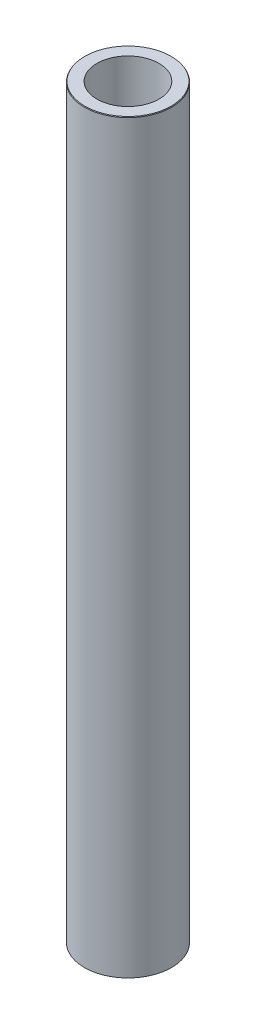
ISO-10303-21;
HEADER;
FILE_DESCRIPTION(('STEP AP214'),'2;1');
FILE_NAME('part.step','',(''),(''),'','','');
FILE_SCHEMA(('AUTOMOTIVE_DESIGN { 1 0 10303 214 1 1 1 1 }'));
ENDSEC;
DATA;
#1=APPLICATION_CONTEXT('core data for automotive mechanical design processes');
#2=APPLICATION_PROTOCOL_DEFINITION('international standard','automotive_design',2000,#1);
#3=PRODUCT_CONTEXT('',#1,'mechanical');
#4=PRODUCT('Part','Part','',(#3));
#5=PRODUCT_RELATED_PRODUCT_CATEGORY('part','',(#4));
#6=PRODUCT_DEFINITION_FORMATION('','',#4);
#7=PRODUCT_DEFINITION_CONTEXT('part definition',#1,'design');
#8=PRODUCT_DEFINITION('design','',#6,#7);
#9=PRODUCT_DEFINITION_SHAPE('','',#8);
#10=(LENGTH_UNIT() NAMED_UNIT(*) SI_UNIT(.MILLI.,.METRE.));
#11=(NAMED_UNIT(*) PLANE_ANGLE_UNIT() SI_UNIT($,.RADIAN.));
#12=(NAMED_UNIT(*) SI_UNIT($,.STERADIAN.) SOLID_ANGLE_UNIT());
#13=UNCERTAINTY_MEASURE_WITH_UNIT(LENGTH_MEASURE(1.E-05),#10,'distance_accuracy_value','');
#14=(GEOMETRIC_REPRESENTATION_CONTEXT(3) GLOBAL_UNCERTAINTY_ASSIGNED_CONTEXT((#13)) GLOBAL_UNIT_ASSIGNED_CONTEXT((#10,
#11,#12)) REPRESENTATION_CONTEXT('',''));
#15=CARTESIAN_POINT('',(0.,0.,0.));
#16=DIRECTION('',(0.,0.,1.));
#17=DIRECTION('',(1.,0.,0.));
#18=AXIS2_PLACEMENT_3D('',#15,#16,#17);
#19=CARTESIAN_POINT('',(0.,256.832149543199,0.));
#20=DIRECTION('',(0.,-1.,0.));
#21=DIRECTION('',(0.,0.,-1.));
#22=AXIS2_PLACEMENT_3D('',#19,#20,#21);
#23=CYLINDRICAL_SURFACE('',#22,15.);
#24=CARTESIAN_POINT('',(0.,256.585456348041,0.));
#25=DIRECTION('',(0.,1.,0.));
#26=DIRECTION('',(0.,0.,1.));
#27=AXIS2_PLACEMENT_3D('',#24,#25,#26);
#28=CIRCLE('',#27,15.);
#29=CARTESIAN_POINT('',(0.,256.585456348041,15.));
#30=VERTEX_POINT('',#29);
#31=EDGE_CURVE('E50',#30,#30,#28,.F.);
#32=ORIENTED_EDGE('',*,*,#31,.T.);
#33=EDGE_LOOP('',(#32));
#34=FACE_BOUND('',#33,.T.);
#35=CARTESIAN_POINT('',(0.,0.14242838263151,0.));
#36=DIRECTION('',(0.,1.,0.));
#37=DIRECTION('',(0.,0.,1.));
#38=AXIS2_PLACEMENT_3D('',#35,#36,#37);
#39=CIRCLE('',#38,15.);
#40=CARTESIAN_POINT('',(0.,0.14242838263151,15.));
#41=VERTEX_POINT('',#40);
#42=EDGE_CURVE('E51',#41,#41,#39,.T.);
#43=ORIENTED_EDGE('',*,*,#42,.T.);
#44=EDGE_LOOP('',(#43));
#45=FACE_BOUND('',#44,.T.);
#46=ADVANCED_FACE('F39',(#34,#45),#23,.T.);
#47=CARTESIAN_POINT('',(0.,256.832149543199,0.));
#48=DIRECTION('',(0.,1.,0.));
#49=DIRECTION('',(0.,0.,1.));
#50=AXIS2_PLACEMENT_3D('',#47,#48,#49);
#51=PLANE('',#50);
#52=CARTESIAN_POINT('',(0.,256.832149543199,0.));
#53=DIRECTION('',(0.,1.,0.));
#54=DIRECTION('',(0.,0.,1.));
#55=AXIS2_PLACEMENT_3D('',#52,#53,#54);
#56=CIRCLE('',#55,14.8575716173684);
#57=CARTESIAN_POINT('',(0.,256.832149543199,14.8575716173684));
#58=VERTEX_POINT('',#57);
#59=EDGE_CURVE('E54',#58,#58,#56,.T.);
#60=ORIENTED_EDGE('',*,*,#59,.T.);
#61=EDGE_LOOP('',(#60));
#62=FACE_BOUND('',#61,.T.);
#63=CARTESIAN_POINT('',(0.,256.832149543199,0.));
#64=DIRECTION('',(0.,1.,0.));
#65=DIRECTION('',(0.,0.,1.));
#66=AXIS2_PLACEMENT_3D('',#63,#64,#65);
#67=CIRCLE('',#66,10.6762683428308);
#68=CARTESIAN_POINT('',(0.,256.832149543199,10.6762683428308));
#69=VERTEX_POINT('',#68);
#70=EDGE_CURVE('E58',#69,#69,#67,.T.);
#71=ORIENTED_EDGE('',*,*,#70,.F.);
#72=EDGE_LOOP('',(#71));
#73=FACE_BOUND('',#72,.T.);
#74=ADVANCED_FACE('F69',(#62,#73),#51,.T.);
#75=CARTESIAN_POINT('',(0.,0.,0.));
#76=DIRECTION('',(0.,1.,0.));
#77=DIRECTION('',(0.,0.,1.));
#78=AXIS2_PLACEMENT_3D('',#75,#76,#77);
#79=PLANE('',#78);
#80=CARTESIAN_POINT('',(0.,0.,0.));
#81=DIRECTION('',(0.,1.,0.));
#82=DIRECTION('',(0.,0.,1.));
#83=AXIS2_PLACEMENT_3D('',#80,#81,#82);
#84=CIRCLE('',#83,14.7533068048423);
#85=CARTESIAN_POINT('',(0.,0.,14.7533068048423));
#86=VERTEX_POINT('',#85);
#87=EDGE_CURVE('E10',#86,#86,#84,.F.);
#88=ORIENTED_EDGE('',*,*,#87,.T.);
#89=EDGE_LOOP('',(#88));
#90=FACE_BOUND('',#89,.T.);
#91=CARTESIAN_POINT('',(0.,0.,0.));
#92=DIRECTION('',(0.,1.,0.));
#93=DIRECTION('',(0.,0.,1.));
#94=AXIS2_PLACEMENT_3D('',#91,#92,#93);
#95=CIRCLE('',#94,10.6762683428308);
#96=CARTESIAN_POINT('',(0.,0.,10.6762683428308));
#97=VERTEX_POINT('',#96);
#98=EDGE_CURVE('E63',#97,#97,#95,.T.);
#99=ORIENTED_EDGE('',*,*,#98,.T.);
#100=EDGE_LOOP('',(#99));
#101=FACE_BOUND('',#100,.T.);
#102=ADVANCED_FACE('F75',(#90,#101),#79,.F.);
#103=CARTESIAN_POINT('',(0.,256.832149543199,0.));
#104=DIRECTION('',(0.,-1.,0.));
#105=DIRECTION('',(0.,0.,-1.));
#106=AXIS2_PLACEMENT_3D('',#103,#104,#105);
#107=CYLINDRICAL_SURFACE('',#106,10.6762683428308);
#108=ORIENTED_EDGE('',*,*,#70,.T.);
#109=EDGE_LOOP('',(#108));
#110=FACE_BOUND('',#109,.T.);
#111=ORIENTED_EDGE('',*,*,#98,.F.);
#112=EDGE_LOOP('',(#111));
#113=FACE_BOUND('',#112,.T.);
#114=ADVANCED_FACE('F70',(#110,#113),#107,.F.);
#115=CARTESIAN_POINT('',(0.,256.832149543199,0.));
#116=DIRECTION('',(0.,-1.,0.));
#117=DIRECTION('',(0.,0.,-1.));
#118=AXIS2_PLACEMENT_3D('',#115,#116,#117);
#119=CONICAL_SURFACE('',#118,14.8575716173684,0.523598775598223);
#120=ORIENTED_EDGE('',*,*,#31,.F.);
#121=EDGE_LOOP('',(#120));
#122=FACE_BOUND('',#121,.T.);
#123=ORIENTED_EDGE('',*,*,#59,.F.);
#124=EDGE_LOOP('',(#123));
#125=FACE_BOUND('',#124,.T.);
#126=ADVANCED_FACE('F81',(#122,#125),#119,.T.);
#127=CARTESIAN_POINT('',(0.,0.14242838263151,0.));
#128=DIRECTION('',(0.,1.,0.));
#129=DIRECTION('',(0.,0.,1.));
#130=AXIS2_PLACEMENT_3D('',#127,#128,#129);
#131=CONICAL_SURFACE('',#130,15.,1.04719755119667);
#132=ORIENTED_EDGE('',*,*,#87,.F.);
#133=EDGE_LOOP('',(#132));
#134=FACE_BOUND('',#133,.T.);
#135=ORIENTED_EDGE('',*,*,#42,.F.);
#136=EDGE_LOOP('',(#135));
#137=FACE_BOUND('',#136,.T.);
#138=ADVANCED_FACE('F45',(#134,#137),#131,.T.);
#139=CLOSED_SHELL('',(#46,#74,#102,#114,#126,#138));
#140=MANIFOLD_SOLID_BREP('B2',#139);
#141=ADVANCED_BREP_SHAPE_REPRESENTATION('',(#18,#140),#14);
#142=SHAPE_DEFINITION_REPRESENTATION(#9,#141);
ENDSEC;
END-ISO-10303-21;
